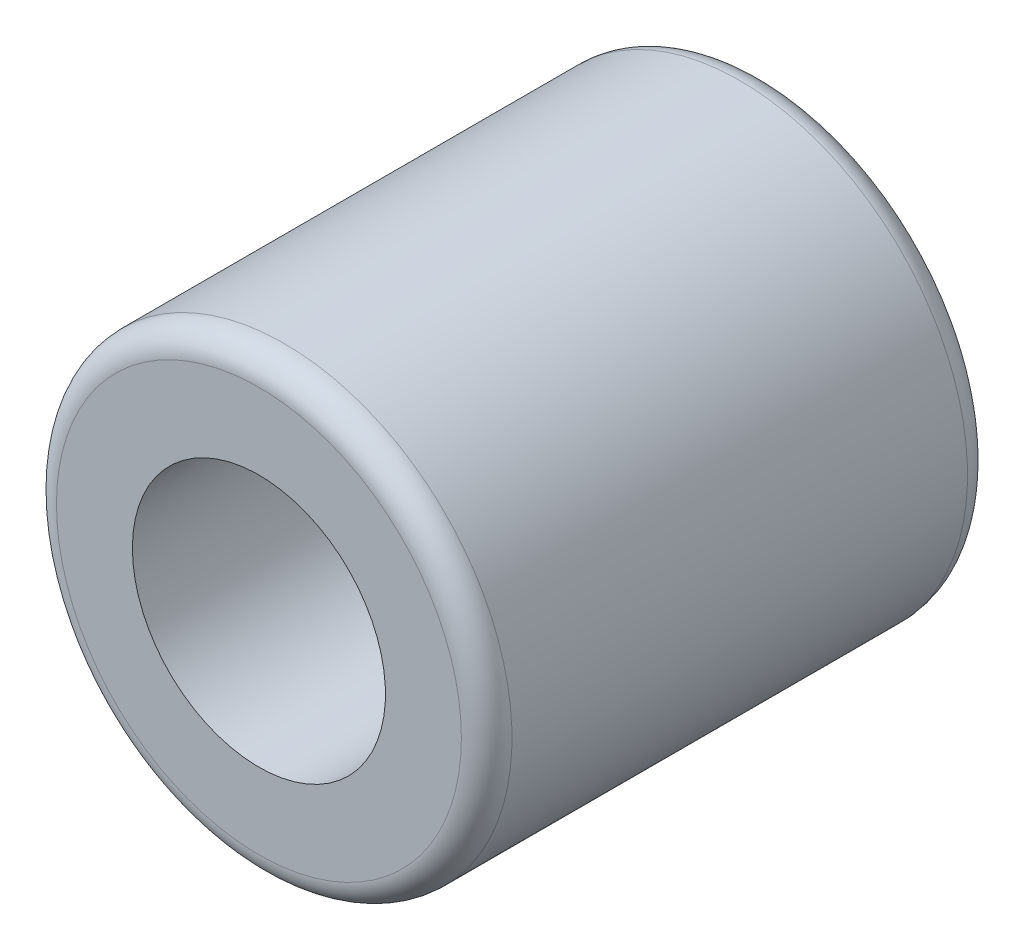
ISO-10303-21;
HEADER;
FILE_DESCRIPTION(('STEP AP214'),'2;1');
FILE_NAME('part.step','',(''),(''),'','','');
FILE_SCHEMA(('AUTOMOTIVE_DESIGN { 1 0 10303 214 1 1 1 1 }'));
ENDSEC;
DATA;
#1=APPLICATION_CONTEXT('core data for automotive mechanical design processes');
#2=APPLICATION_PROTOCOL_DEFINITION('international standard','automotive_design',2000,#1);
#3=PRODUCT_CONTEXT('',#1,'mechanical');
#4=PRODUCT('Part','Part','',(#3));
#5=PRODUCT_RELATED_PRODUCT_CATEGORY('part','',(#4));
#6=PRODUCT_DEFINITION_FORMATION('','',#4);
#7=PRODUCT_DEFINITION_CONTEXT('part definition',#1,'design');
#8=PRODUCT_DEFINITION('design','',#6,#7);
#9=PRODUCT_DEFINITION_SHAPE('','',#8);
#10=(LENGTH_UNIT() NAMED_UNIT(*) SI_UNIT(.MILLI.,.METRE.));
#11=(NAMED_UNIT(*) PLANE_ANGLE_UNIT() SI_UNIT($,.RADIAN.));
#12=(NAMED_UNIT(*) SI_UNIT($,.STERADIAN.) SOLID_ANGLE_UNIT());
#13=UNCERTAINTY_MEASURE_WITH_UNIT(LENGTH_MEASURE(1.E-05),#10,'distance_accuracy_value','');
#14=(GEOMETRIC_REPRESENTATION_CONTEXT(3) GLOBAL_UNCERTAINTY_ASSIGNED_CONTEXT((#13)) GLOBAL_UNIT_ASSIGNED_CONTEXT((#10,
#11,#12)) REPRESENTATION_CONTEXT('',''));
#15=CARTESIAN_POINT('',(0.,0.,0.));
#16=DIRECTION('',(0.,0.,1.));
#17=DIRECTION('',(1.,0.,0.));
#18=AXIS2_PLACEMENT_3D('',#15,#16,#17);
#19=CARTESIAN_POINT('',(551.894917120642,100.815701745268,-73.0563605183514));
#20=DIRECTION('',(0.,0.,-1.));
#21=DIRECTION('',(-1.,0.,0.));
#22=AXIS2_PLACEMENT_3D('',#19,#20,#21);
#23=CYLINDRICAL_SURFACE('',#22,5.);
#24=CARTESIAN_POINT('',(551.894917120642,100.815701745268,-73.0563605183514));
#25=DIRECTION('',(0.,0.,-1.));
#26=DIRECTION('',(-1.,0.,0.));
#27=AXIS2_PLACEMENT_3D('',#24,#25,#26);
#28=CIRCLE('',#27,5.);
#29=CARTESIAN_POINT('',(546.894917120642,100.815701745268,-73.0563605183514));
#30=VERTEX_POINT('',#29);
#31=EDGE_CURVE('E53',#30,#30,#28,.F.);
#32=ORIENTED_EDGE('',*,*,#31,.T.);
#33=EDGE_LOOP('',(#32));
#34=FACE_BOUND('',#33,.T.);
#35=CARTESIAN_POINT('',(551.894917120642,100.815701745268,-93.0563605183514));
#36=DIRECTION('',(0.,0.,-1.));
#37=DIRECTION('',(-1.,0.,0.));
#38=AXIS2_PLACEMENT_3D('',#35,#36,#37);
#39=CIRCLE('',#38,5.);
#40=CARTESIAN_POINT('',(546.894917120642,100.815701745268,-93.0563605183514));
#41=VERTEX_POINT('',#40);
#42=EDGE_CURVE('E185',#41,#41,#39,.F.);
#43=ORIENTED_EDGE('',*,*,#42,.F.);
#44=EDGE_LOOP('',(#43));
#45=FACE_BOUND('',#44,.T.);
#46=ADVANCED_FACE('F17',(#34,#45),#23,.F.);
#47=CARTESIAN_POINT('',(550.989878426496,104.310878070249,-93.0563605183514));
#48=DIRECTION('',(0.,0.,-1.));
#49=DIRECTION('',(-1.,0.,0.));
#50=AXIS2_PLACEMENT_3D('',#47,#48,#49);
#51=PLANE('',#50);
#52=CARTESIAN_POINT('',(551.894917120642,100.815701745268,-93.0563605183514));
#53=DIRECTION('',(0.,0.,1.));
#54=DIRECTION('',(-1.,0.,0.));
#55=AXIS2_PLACEMENT_3D('',#52,#53,#54);
#56=CIRCLE('',#55,8.00000000000001);
#57=CARTESIAN_POINT('',(543.894917120642,100.815701745268,-93.0563605183514));
#58=VERTEX_POINT('',#57);
#59=CARTESIAN_POINT('',(559.894917120642,100.815701745268,-93.0563605183514));
#60=VERTEX_POINT('',#59);
#61=EDGE_CURVE('E45',#58,#60,#56,.T.);
#62=ORIENTED_EDGE('',*,*,#61,.F.);
#63=CARTESIAN_POINT('',(551.894917120642,100.815701745268,-93.0563605183514));
#64=DIRECTION('',(0.,0.,1.));
#65=DIRECTION('',(1.,0.,0.));
#66=AXIS2_PLACEMENT_3D('',#63,#64,#65);
#67=CIRCLE('',#66,8.00000000000001);
#68=EDGE_CURVE('E48',#60,#58,#67,.T.);
#69=ORIENTED_EDGE('',*,*,#68,.F.);
#70=EDGE_LOOP('',(#62,#69));
#71=FACE_BOUND('',#70,.T.);
#72=ORIENTED_EDGE('',*,*,#42,.T.);
#73=EDGE_LOOP('',(#72));
#74=FACE_BOUND('',#73,.T.);
#75=ADVANCED_FACE('F50',(#71,#74),#51,.T.);
#76=CARTESIAN_POINT('',(550.989878426496,104.310878070249,-73.0563605183514));
#77=DIRECTION('',(0.,0.,-1.));
#78=DIRECTION('',(-1.,0.,0.));
#79=AXIS2_PLACEMENT_3D('',#76,#77,#78);
#80=PLANE('',#79);
#81=CARTESIAN_POINT('',(551.894917120642,100.815701745268,-73.0563605183514));
#82=DIRECTION('',(0.,0.,-1.));
#83=DIRECTION('',(-1.,0.,0.));
#84=AXIS2_PLACEMENT_3D('',#81,#82,#83);
#85=CIRCLE('',#84,8.00000000000001);
#86=CARTESIAN_POINT('',(543.894917120642,100.815701745268,-73.0563605183514));
#87=VERTEX_POINT('',#86);
#88=CARTESIAN_POINT('',(559.894917120642,100.815701745268,-73.0563605183514));
#89=VERTEX_POINT('',#88);
#90=EDGE_CURVE('E36',#87,#89,#85,.T.);
#91=ORIENTED_EDGE('',*,*,#90,.F.);
#92=CARTESIAN_POINT('',(551.894917120642,100.815701745268,-73.0563605183514));
#93=DIRECTION('',(0.,0.,-1.));
#94=DIRECTION('',(1.,0.,0.));
#95=AXIS2_PLACEMENT_3D('',#92,#93,#94);
#96=CIRCLE('',#95,8.00000000000001);
#97=EDGE_CURVE('E58',#89,#87,#96,.T.);
#98=ORIENTED_EDGE('',*,*,#97,.F.);
#99=EDGE_LOOP('',(#91,#98));
#100=FACE_BOUND('',#99,.T.);
#101=ORIENTED_EDGE('',*,*,#31,.F.);
#102=EDGE_LOOP('',(#101));
#103=FACE_BOUND('',#102,.T.);
#104=ADVANCED_FACE('F77',(#100,#103),#80,.F.);
#105=CARTESIAN_POINT('',(551.894917120642,100.815701745268,-92.0563605183514));
#106=DIRECTION('',(0.,0.,-1.));
#107=DIRECTION('',(-1.,0.,0.));
#108=AXIS2_PLACEMENT_3D('',#105,#106,#107);
#109=TOROIDAL_SURFACE('',#108,8.00000000000001,1.);
#110=CARTESIAN_POINT('',(551.894917120642,100.815701745268,-92.0563605183514));
#111=DIRECTION('',(0.,0.,-1.));
#112=DIRECTION('',(-1.,0.,0.));
#113=AXIS2_PLACEMENT_3D('',#110,#111,#112);
#114=CIRCLE('',#113,9.);
#115=CARTESIAN_POINT('',(542.894917120642,100.815701745268,-92.0563605183514));
#116=VERTEX_POINT('',#115);
#117=EDGE_CURVE('E28',#116,#116,#114,.F.);
#118=ORIENTED_EDGE('',*,*,#117,.F.);
#119=EDGE_LOOP('',(#118));
#120=FACE_BOUND('',#119,.T.);
#121=ORIENTED_EDGE('',*,*,#61,.T.);
#122=ORIENTED_EDGE('',*,*,#68,.T.);
#123=EDGE_LOOP('',(#121,#122));
#124=FACE_BOUND('',#123,.T.);
#125=ADVANCED_FACE('F57',(#120,#124),#109,.T.);
#126=CARTESIAN_POINT('',(551.894917120642,100.815701745268,-74.0563605183514));
#127=DIRECTION('',(0.,0.,-1.));
#128=DIRECTION('',(-1.,0.,0.));
#129=AXIS2_PLACEMENT_3D('',#126,#127,#128);
#130=TOROIDAL_SURFACE('',#129,8.00000000000001,1.);
#131=CARTESIAN_POINT('',(551.894917120642,100.815701745268,-74.0563605183514));
#132=DIRECTION('',(0.,0.,-1.));
#133=DIRECTION('',(-1.,0.,0.));
#134=AXIS2_PLACEMENT_3D('',#131,#132,#133);
#135=CIRCLE('',#134,9.);
#136=CARTESIAN_POINT('',(542.894917120642,100.815701745268,-74.0563605183514));
#137=VERTEX_POINT('',#136);
#138=EDGE_CURVE('E11',#137,#137,#135,.T.);
#139=ORIENTED_EDGE('',*,*,#138,.F.);
#140=EDGE_LOOP('',(#139));
#141=FACE_BOUND('',#140,.T.);
#142=ORIENTED_EDGE('',*,*,#97,.T.);
#143=ORIENTED_EDGE('',*,*,#90,.T.);
#144=EDGE_LOOP('',(#142,#143));
#145=FACE_BOUND('',#144,.T.);
#146=ADVANCED_FACE('F76',(#141,#145),#130,.T.);
#147=CARTESIAN_POINT('',(551.894917120642,100.815701745268,-73.0563605183514));
#148=DIRECTION('',(0.,0.,-1.));
#149=DIRECTION('',(-1.,0.,0.));
#150=AXIS2_PLACEMENT_3D('',#147,#148,#149);
#151=CYLINDRICAL_SURFACE('',#150,9.);
#152=ORIENTED_EDGE('',*,*,#138,.T.);
#153=EDGE_LOOP('',(#152));
#154=FACE_BOUND('',#153,.T.);
#155=ORIENTED_EDGE('',*,*,#117,.T.);
#156=EDGE_LOOP('',(#155));
#157=FACE_BOUND('',#156,.T.);
#158=ADVANCED_FACE('F130',(#154,#157),#151,.T.);
#159=CLOSED_SHELL('',(#46,#75,#104,#125,#146,#158));
#160=MANIFOLD_SOLID_BREP('B1',#159);
#161=ADVANCED_BREP_SHAPE_REPRESENTATION('',(#18,#160),#14);
#162=SHAPE_DEFINITION_REPRESENTATION(#9,#161);
ENDSEC;
END-ISO-10303-21;
